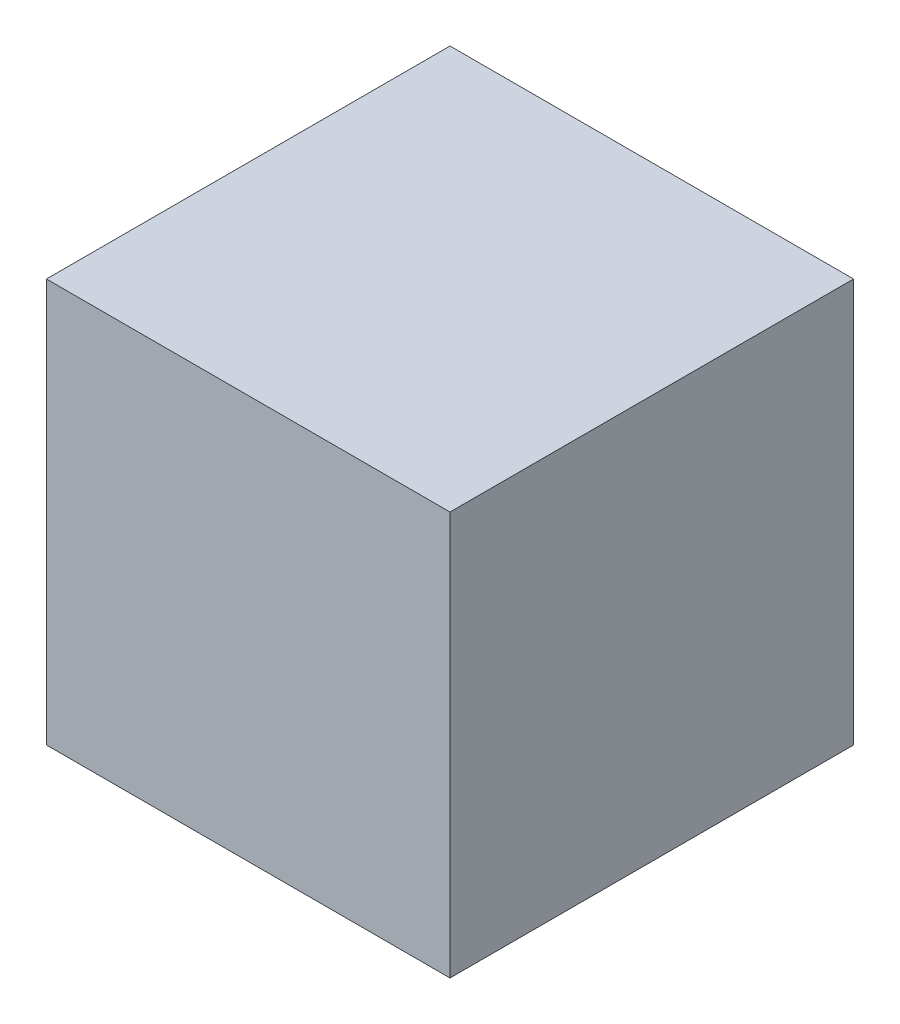
ISO-10303-21;
HEADER;
FILE_DESCRIPTION(('STEP AP214'),'2;1');
FILE_NAME('part.step','',(''),(''),'','','');
FILE_SCHEMA(('AUTOMOTIVE_DESIGN { 1 0 10303 214 1 1 1 1 }'));
ENDSEC;
DATA;
#1=APPLICATION_CONTEXT('core data for automotive mechanical design processes');
#2=APPLICATION_PROTOCOL_DEFINITION('international standard','automotive_design',2000,#1);
#3=PRODUCT_CONTEXT('',#1,'mechanical');
#4=PRODUCT('Part','Part','',(#3));
#5=PRODUCT_RELATED_PRODUCT_CATEGORY('part','',(#4));
#6=PRODUCT_DEFINITION_FORMATION('','',#4);
#7=PRODUCT_DEFINITION_CONTEXT('part definition',#1,'design');
#8=PRODUCT_DEFINITION('design','',#6,#7);
#9=PRODUCT_DEFINITION_SHAPE('','',#8);
#10=(LENGTH_UNIT() NAMED_UNIT(*) SI_UNIT(.MILLI.,.METRE.));
#11=(NAMED_UNIT(*) PLANE_ANGLE_UNIT() SI_UNIT($,.RADIAN.));
#12=(NAMED_UNIT(*) SI_UNIT($,.STERADIAN.) SOLID_ANGLE_UNIT());
#13=UNCERTAINTY_MEASURE_WITH_UNIT(LENGTH_MEASURE(1.E-05),#10,'distance_accuracy_value','');
#14=(GEOMETRIC_REPRESENTATION_CONTEXT(3) GLOBAL_UNCERTAINTY_ASSIGNED_CONTEXT((#13)) GLOBAL_UNIT_ASSIGNED_CONTEXT((#10,
#11,#12)) REPRESENTATION_CONTEXT('',''));
#15=CARTESIAN_POINT('',(0.,0.,0.));
#16=DIRECTION('',(0.,0.,1.));
#17=DIRECTION('',(1.,0.,0.));
#18=AXIS2_PLACEMENT_3D('',#15,#16,#17);
#19=CARTESIAN_POINT('',(0.1905,0.0635,-0.0635));
#20=DIRECTION('',(1.,0.,0.));
#21=DIRECTION('',(0.,0.,-1.));
#22=AXIS2_PLACEMENT_3D('',#19,#20,#21);
#23=PLANE('',#22);
#24=DIRECTION('',(0.,0.,1.));
#25=VECTOR('',#24,1.);
#26=CARTESIAN_POINT('',(0.1905,0.1905,-0.1905));
#27=LINE('',#26,#25);
#28=CARTESIAN_POINT('',(0.1905,0.1905,-0.0635));
#29=VERTEX_POINT('',#28);
#30=CARTESIAN_POINT('',(0.1905,0.1905,-0.1905));
#31=VERTEX_POINT('',#30);
#32=EDGE_CURVE('E89',#29,#31,#27,.F.);
#33=ORIENTED_EDGE('',*,*,#32,.F.);
#34=DIRECTION('',(0.,1.,0.));
#35=VECTOR('',#34,1.);
#36=CARTESIAN_POINT('',(0.1905,0.1905,-0.0635));
#37=LINE('',#36,#35);
#38=CARTESIAN_POINT('',(0.1905,0.0635,-0.0635));
#39=VERTEX_POINT('',#38);
#40=EDGE_CURVE('E41',#39,#29,#37,.T.);
#41=ORIENTED_EDGE('',*,*,#40,.F.);
#42=DIRECTION('',(0.,0.,-1.));
#43=VECTOR('',#42,1.);
#44=CARTESIAN_POINT('',(0.1905,0.0635,-0.0635));
#45=LINE('',#44,#43);
#46=CARTESIAN_POINT('',(0.1905,0.0635,-0.1905));
#47=VERTEX_POINT('',#46);
#48=EDGE_CURVE('E79',#47,#39,#45,.F.);
#49=ORIENTED_EDGE('',*,*,#48,.F.);
#50=DIRECTION('',(0.,1.,0.));
#51=VECTOR('',#50,1.);
#52=CARTESIAN_POINT('',(0.1905,0.0635,-0.1905));
#53=LINE('',#52,#51);
#54=EDGE_CURVE('E74',#31,#47,#53,.F.);
#55=ORIENTED_EDGE('',*,*,#54,.F.);
#56=EDGE_LOOP('',(#33,#41,#49,#55));
#57=FACE_BOUND('',#56,.T.);
#58=ADVANCED_FACE('F38',(#57),#23,.T.);
#59=CARTESIAN_POINT('',(0.0635,0.1905,-0.0635));
#60=DIRECTION('',(0.,0.,1.));
#61=DIRECTION('',(1.,0.,0.));
#62=AXIS2_PLACEMENT_3D('',#59,#60,#61);
#63=PLANE('',#62);
#64=DIRECTION('',(1.,0.,0.));
#65=VECTOR('',#64,1.);
#66=CARTESIAN_POINT('',(0.0635,0.1905,-0.0635));
#67=LINE('',#66,#65);
#68=CARTESIAN_POINT('',(0.0635,0.1905,-0.0635));
#69=VERTEX_POINT('',#68);
#70=EDGE_CURVE('E100',#69,#29,#67,.T.);
#71=ORIENTED_EDGE('',*,*,#70,.F.);
#72=DIRECTION('',(0.,1.,0.));
#73=VECTOR('',#72,1.);
#74=CARTESIAN_POINT('',(0.0635,0.0635,-0.0635));
#75=LINE('',#74,#73);
#76=CARTESIAN_POINT('',(0.0635,0.0635,-0.0635));
#77=VERTEX_POINT('',#76);
#78=EDGE_CURVE('E95',#69,#77,#75,.F.);
#79=ORIENTED_EDGE('',*,*,#78,.T.);
#80=DIRECTION('',(1.,0.,0.));
#81=VECTOR('',#80,1.);
#82=CARTESIAN_POINT('',(0.0635,0.0635,-0.0635));
#83=LINE('',#82,#81);
#84=EDGE_CURVE('E84',#39,#77,#83,.F.);
#85=ORIENTED_EDGE('',*,*,#84,.F.);
#86=ORIENTED_EDGE('',*,*,#40,.T.);
#87=EDGE_LOOP('',(#71,#79,#85,#86));
#88=FACE_BOUND('',#87,.T.);
#89=ADVANCED_FACE('F94',(#88),#63,.T.);
#90=CARTESIAN_POINT('',(0.0635,0.0635,-0.0635));
#91=DIRECTION('',(0.,-1.,0.));
#92=DIRECTION('',(0.,0.,-1.));
#93=AXIS2_PLACEMENT_3D('',#90,#91,#92);
#94=PLANE('',#93);
#95=ORIENTED_EDGE('',*,*,#84,.T.);
#96=DIRECTION('',(0.,0.,-1.));
#97=VECTOR('',#96,1.);
#98=CARTESIAN_POINT('',(0.0635,0.0635,-0.0635));
#99=LINE('',#98,#97);
#100=CARTESIAN_POINT('',(0.0635,0.0635,-0.1905));
#101=VERTEX_POINT('',#100);
#102=EDGE_CURVE('E105',#77,#101,#99,.T.);
#103=ORIENTED_EDGE('',*,*,#102,.T.);
#104=DIRECTION('',(-1.,0.,0.));
#105=VECTOR('',#104,1.);
#106=CARTESIAN_POINT('',(0.0635,0.0635,-0.1905));
#107=LINE('',#106,#105);
#108=EDGE_CURVE('E86',#47,#101,#107,.T.);
#109=ORIENTED_EDGE('',*,*,#108,.F.);
#110=ORIENTED_EDGE('',*,*,#48,.T.);
#111=EDGE_LOOP('',(#95,#103,#109,#110));
#112=FACE_BOUND('',#111,.T.);
#113=ADVANCED_FACE('F81',(#112),#94,.T.);
#114=CARTESIAN_POINT('',(0.0635,0.0635,-0.1905));
#115=DIRECTION('',(0.,0.,-1.));
#116=DIRECTION('',(-1.,0.,0.));
#117=AXIS2_PLACEMENT_3D('',#114,#115,#116);
#118=PLANE('',#117);
#119=ORIENTED_EDGE('',*,*,#108,.T.);
#120=DIRECTION('',(0.,1.,0.));
#121=VECTOR('',#120,1.);
#122=CARTESIAN_POINT('',(0.0635,0.0635,-0.1905));
#123=LINE('',#122,#121);
#124=CARTESIAN_POINT('',(0.0635,0.1905,-0.1905));
#125=VERTEX_POINT('',#124);
#126=EDGE_CURVE('E47',#101,#125,#123,.T.);
#127=ORIENTED_EDGE('',*,*,#126,.T.);
#128=DIRECTION('',(1.,0.,0.));
#129=VECTOR('',#128,1.);
#130=CARTESIAN_POINT('',(0.0635,0.1905,-0.1905));
#131=LINE('',#130,#129);
#132=EDGE_CURVE('E55',#31,#125,#131,.F.);
#133=ORIENTED_EDGE('',*,*,#132,.F.);
#134=ORIENTED_EDGE('',*,*,#54,.T.);
#135=EDGE_LOOP('',(#119,#127,#133,#134));
#136=FACE_BOUND('',#135,.T.);
#137=ADVANCED_FACE('F109',(#136),#118,.T.);
#138=CARTESIAN_POINT('',(0.0635,0.1905,-0.1905));
#139=DIRECTION('',(0.,1.,0.));
#140=DIRECTION('',(0.,0.,1.));
#141=AXIS2_PLACEMENT_3D('',#138,#139,#140);
#142=PLANE('',#141);
#143=ORIENTED_EDGE('',*,*,#132,.T.);
#144=DIRECTION('',(0.,0.,-1.));
#145=VECTOR('',#144,1.);
#146=CARTESIAN_POINT('',(0.0635,0.1905,-0.0635));
#147=LINE('',#146,#145);
#148=EDGE_CURVE('E11',#125,#69,#147,.F.);
#149=ORIENTED_EDGE('',*,*,#148,.T.);
#150=ORIENTED_EDGE('',*,*,#70,.T.);
#151=ORIENTED_EDGE('',*,*,#32,.T.);
#152=EDGE_LOOP('',(#143,#149,#150,#151));
#153=FACE_BOUND('',#152,.T.);
#154=ADVANCED_FACE('F112',(#153),#142,.T.);
#155=CARTESIAN_POINT('',(0.0635,0.0635,-0.0635));
#156=DIRECTION('',(1.,0.,0.));
#157=DIRECTION('',(0.,0.,-1.));
#158=AXIS2_PLACEMENT_3D('',#155,#156,#157);
#159=PLANE('',#158);
#160=ORIENTED_EDGE('',*,*,#126,.F.);
#161=ORIENTED_EDGE('',*,*,#102,.F.);
#162=ORIENTED_EDGE('',*,*,#78,.F.);
#163=ORIENTED_EDGE('',*,*,#148,.F.);
#164=EDGE_LOOP('',(#160,#161,#162,#163));
#165=FACE_BOUND('',#164,.T.);
#166=ADVANCED_FACE('F111',(#165),#159,.F.);
#167=CLOSED_SHELL('',(#58,#89,#113,#137,#154,#166));
#168=MANIFOLD_SOLID_BREP('B2',#167);
#169=ADVANCED_BREP_SHAPE_REPRESENTATION('',(#18,#168),#14);
#170=SHAPE_DEFINITION_REPRESENTATION(#9,#169);
ENDSEC;
END-ISO-10303-21;
